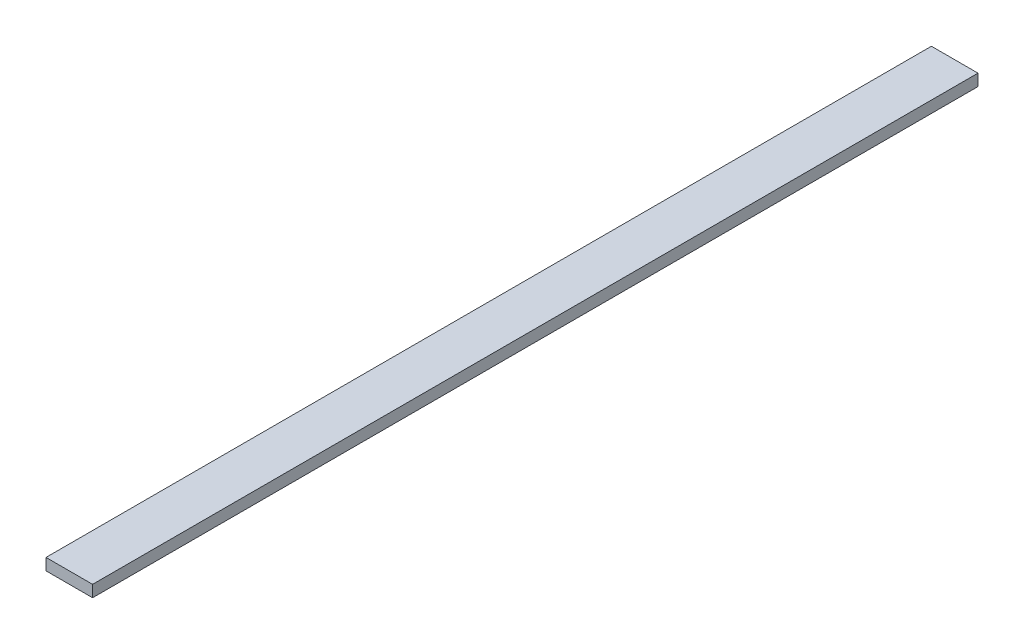
ISO-10303-21;
HEADER;
FILE_DESCRIPTION(('STEP AP214'),'2;1');
FILE_NAME('part.step','',(''),(''),'','','');
FILE_SCHEMA(('AUTOMOTIVE_DESIGN { 1 0 10303 214 1 1 1 1 }'));
ENDSEC;
DATA;
#1=APPLICATION_CONTEXT('core data for automotive mechanical design processes');
#2=APPLICATION_PROTOCOL_DEFINITION('international standard','automotive_design',2000,#1);
#3=PRODUCT_CONTEXT('',#1,'mechanical');
#4=PRODUCT('Part','Part','',(#3));
#5=PRODUCT_RELATED_PRODUCT_CATEGORY('part','',(#4));
#6=PRODUCT_DEFINITION_FORMATION('','',#4);
#7=PRODUCT_DEFINITION_CONTEXT('part definition',#1,'design');
#8=PRODUCT_DEFINITION('design','',#6,#7);
#9=PRODUCT_DEFINITION_SHAPE('','',#8);
#10=(LENGTH_UNIT() NAMED_UNIT(*) SI_UNIT(.MILLI.,.METRE.));
#11=(NAMED_UNIT(*) PLANE_ANGLE_UNIT() SI_UNIT($,.RADIAN.));
#12=(NAMED_UNIT(*) SI_UNIT($,.STERADIAN.) SOLID_ANGLE_UNIT());
#13=UNCERTAINTY_MEASURE_WITH_UNIT(LENGTH_MEASURE(1.E-05),#10,'distance_accuracy_value','');
#14=(GEOMETRIC_REPRESENTATION_CONTEXT(3) GLOBAL_UNCERTAINTY_ASSIGNED_CONTEXT((#13)) GLOBAL_UNIT_ASSIGNED_CONTEXT((#10,
#11,#12)) REPRESENTATION_CONTEXT('',''));
#15=CARTESIAN_POINT('',(0.,0.,0.));
#16=DIRECTION('',(0.,0.,1.));
#17=DIRECTION('',(1.,0.,0.));
#18=AXIS2_PLACEMENT_3D('',#15,#16,#17);
#19=CARTESIAN_POINT('',(0.,0.,-241.3));
#20=DIRECTION('',(1.,0.,0.));
#21=DIRECTION('',(0.,0.,1.));
#22=AXIS2_PLACEMENT_3D('',#19,#20,#21);
#23=PLANE('',#22);
#24=DIRECTION('',(0.,-1.,0.));
#25=VECTOR('',#24,1.);
#26=CARTESIAN_POINT('',(0.,0.,0.));
#27=LINE('',#26,#25);
#28=CARTESIAN_POINT('',(0.,3.175,0.));
#29=VERTEX_POINT('',#28);
#30=CARTESIAN_POINT('',(0.,0.,0.));
#31=VERTEX_POINT('',#30);
#32=EDGE_CURVE('E104',#29,#31,#27,.T.);
#33=ORIENTED_EDGE('',*,*,#32,.F.);
#34=DIRECTION('',(0.,0.,1.));
#35=VECTOR('',#34,1.);
#36=CARTESIAN_POINT('',(0.,3.175,-241.3));
#37=LINE('',#36,#35);
#38=CARTESIAN_POINT('',(0.,3.175,-241.3));
#39=VERTEX_POINT('',#38);
#40=EDGE_CURVE('E103',#39,#29,#37,.T.);
#41=ORIENTED_EDGE('',*,*,#40,.F.);
#42=DIRECTION('',(0.,-1.,0.));
#43=VECTOR('',#42,1.);
#44=CARTESIAN_POINT('',(0.,0.,-241.3));
#45=LINE('',#44,#43);
#46=CARTESIAN_POINT('',(0.,0.,-241.3));
#47=VERTEX_POINT('',#46);
#48=EDGE_CURVE('E98',#39,#47,#45,.T.);
#49=ORIENTED_EDGE('',*,*,#48,.T.);
#50=DIRECTION('',(0.,0.,1.));
#51=VECTOR('',#50,1.);
#52=CARTESIAN_POINT('',(0.,0.,-241.3));
#53=LINE('',#52,#51);
#54=EDGE_CURVE('E11',#47,#31,#53,.T.);
#55=ORIENTED_EDGE('',*,*,#54,.T.);
#56=EDGE_LOOP('',(#33,#41,#49,#55));
#57=FACE_BOUND('',#56,.T.);
#58=ADVANCED_FACE('F41',(#57),#23,.F.);
#59=CARTESIAN_POINT('',(0.,0.,-241.3));
#60=DIRECTION('',(0.,1.,0.));
#61=DIRECTION('',(0.,0.,-1.));
#62=AXIS2_PLACEMENT_3D('',#59,#60,#61);
#63=PLANE('',#62);
#64=DIRECTION('',(1.,0.,0.));
#65=VECTOR('',#64,1.);
#66=CARTESIAN_POINT('',(0.,0.,0.));
#67=LINE('',#66,#65);
#68=CARTESIAN_POINT('',(12.7,0.,0.));
#69=VERTEX_POINT('',#68);
#70=EDGE_CURVE('E106',#31,#69,#67,.T.);
#71=ORIENTED_EDGE('',*,*,#70,.F.);
#72=ORIENTED_EDGE('',*,*,#54,.F.);
#73=DIRECTION('',(1.,0.,0.));
#74=VECTOR('',#73,1.);
#75=CARTESIAN_POINT('',(0.,0.,-241.3));
#76=LINE('',#75,#74);
#77=CARTESIAN_POINT('',(12.7,0.,-241.3));
#78=VERTEX_POINT('',#77);
#79=EDGE_CURVE('E82',#47,#78,#76,.T.);
#80=ORIENTED_EDGE('',*,*,#79,.T.);
#81=DIRECTION('',(0.,0.,1.));
#82=VECTOR('',#81,1.);
#83=CARTESIAN_POINT('',(12.7,0.,-241.3));
#84=LINE('',#83,#82);
#85=EDGE_CURVE('E49',#78,#69,#84,.T.);
#86=ORIENTED_EDGE('',*,*,#85,.T.);
#87=EDGE_LOOP('',(#71,#72,#80,#86));
#88=FACE_BOUND('',#87,.T.);
#89=ADVANCED_FACE('F96',(#88),#63,.F.);
#90=CARTESIAN_POINT('',(12.7,0.,-241.3));
#91=DIRECTION('',(-1.,0.,0.));
#92=DIRECTION('',(0.,0.,-1.));
#93=AXIS2_PLACEMENT_3D('',#90,#91,#92);
#94=PLANE('',#93);
#95=DIRECTION('',(0.,1.,0.));
#96=VECTOR('',#95,1.);
#97=CARTESIAN_POINT('',(12.7,0.,0.));
#98=LINE('',#97,#96);
#99=CARTESIAN_POINT('',(12.7,3.175,0.));
#100=VERTEX_POINT('',#99);
#101=EDGE_CURVE('E92',#69,#100,#98,.T.);
#102=ORIENTED_EDGE('',*,*,#101,.F.);
#103=ORIENTED_EDGE('',*,*,#85,.F.);
#104=DIRECTION('',(0.,1.,0.));
#105=VECTOR('',#104,1.);
#106=CARTESIAN_POINT('',(12.7,0.,-241.3));
#107=LINE('',#106,#105);
#108=CARTESIAN_POINT('',(12.7,3.175,-241.3));
#109=VERTEX_POINT('',#108);
#110=EDGE_CURVE('E85',#78,#109,#107,.T.);
#111=ORIENTED_EDGE('',*,*,#110,.T.);
#112=DIRECTION('',(0.,0.,1.));
#113=VECTOR('',#112,1.);
#114=CARTESIAN_POINT('',(12.7,3.175,-241.3));
#115=LINE('',#114,#113);
#116=EDGE_CURVE('E95',#109,#100,#115,.T.);
#117=ORIENTED_EDGE('',*,*,#116,.T.);
#118=EDGE_LOOP('',(#102,#103,#111,#117));
#119=FACE_BOUND('',#118,.T.);
#120=ADVANCED_FACE('F91',(#119),#94,.F.);
#121=CARTESIAN_POINT('',(0.,3.175,-241.3));
#122=DIRECTION('',(0.,-1.,0.));
#123=DIRECTION('',(0.,0.,1.));
#124=AXIS2_PLACEMENT_3D('',#121,#122,#123);
#125=PLANE('',#124);
#126=DIRECTION('',(-1.,0.,0.));
#127=VECTOR('',#126,1.);
#128=CARTESIAN_POINT('',(0.,3.175,0.));
#129=LINE('',#128,#127);
#130=EDGE_CURVE('E71',#100,#29,#129,.T.);
#131=ORIENTED_EDGE('',*,*,#130,.F.);
#132=ORIENTED_EDGE('',*,*,#116,.F.);
#133=DIRECTION('',(-1.,0.,0.));
#134=VECTOR('',#133,1.);
#135=CARTESIAN_POINT('',(0.,3.175,-241.3));
#136=LINE('',#135,#134);
#137=EDGE_CURVE('E57',#109,#39,#136,.T.);
#138=ORIENTED_EDGE('',*,*,#137,.T.);
#139=ORIENTED_EDGE('',*,*,#40,.T.);
#140=EDGE_LOOP('',(#131,#132,#138,#139));
#141=FACE_BOUND('',#140,.T.);
#142=ADVANCED_FACE('F115',(#141),#125,.F.);
#143=CARTESIAN_POINT('',(0.,0.,-241.3));
#144=DIRECTION('',(0.,0.,1.));
#145=DIRECTION('',(-1.,0.,0.));
#146=AXIS2_PLACEMENT_3D('',#143,#144,#145);
#147=PLANE('',#146);
#148=ORIENTED_EDGE('',*,*,#48,.F.);
#149=ORIENTED_EDGE('',*,*,#137,.F.);
#150=ORIENTED_EDGE('',*,*,#110,.F.);
#151=ORIENTED_EDGE('',*,*,#79,.F.);
#152=EDGE_LOOP('',(#148,#149,#150,#151));
#153=FACE_BOUND('',#152,.T.);
#154=ADVANCED_FACE('F87',(#153),#147,.F.);
#155=CARTESIAN_POINT('',(0.,0.,0.));
#156=DIRECTION('',(0.,0.,1.));
#157=DIRECTION('',(-1.,0.,0.));
#158=AXIS2_PLACEMENT_3D('',#155,#156,#157);
#159=PLANE('',#158);
#160=ORIENTED_EDGE('',*,*,#32,.T.);
#161=ORIENTED_EDGE('',*,*,#70,.T.);
#162=ORIENTED_EDGE('',*,*,#101,.T.);
#163=ORIENTED_EDGE('',*,*,#130,.T.);
#164=EDGE_LOOP('',(#160,#161,#162,#163));
#165=FACE_BOUND('',#164,.T.);
#166=ADVANCED_FACE('F111',(#165),#159,.T.);
#167=CLOSED_SHELL('',(#58,#89,#120,#142,#154,#166));
#168=MANIFOLD_SOLID_BREP('B2',#167);
#169=ADVANCED_BREP_SHAPE_REPRESENTATION('',(#18,#168),#14);
#170=SHAPE_DEFINITION_REPRESENTATION(#9,#169);
ENDSEC;
END-ISO-10303-21;
